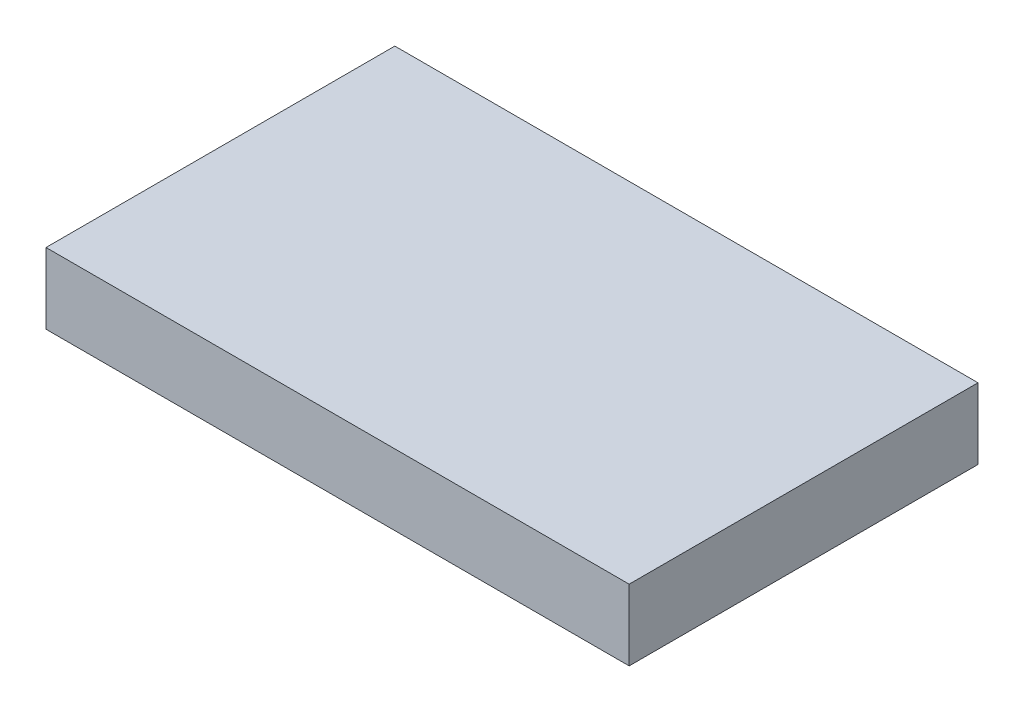
ISO-10303-21;
HEADER;
FILE_DESCRIPTION(('STEP AP214'),'2;1');
FILE_NAME('part.step','',(''),(''),'','','');
FILE_SCHEMA(('AUTOMOTIVE_DESIGN { 1 0 10303 214 1 1 1 1 }'));
ENDSEC;
DATA;
#1=APPLICATION_CONTEXT('core data for automotive mechanical design processes');
#2=APPLICATION_PROTOCOL_DEFINITION('international standard','automotive_design',2000,#1);
#3=PRODUCT_CONTEXT('',#1,'mechanical');
#4=PRODUCT('Part','Part','',(#3));
#5=PRODUCT_RELATED_PRODUCT_CATEGORY('part','',(#4));
#6=PRODUCT_DEFINITION_FORMATION('','',#4);
#7=PRODUCT_DEFINITION_CONTEXT('part definition',#1,'design');
#8=PRODUCT_DEFINITION('design','',#6,#7);
#9=PRODUCT_DEFINITION_SHAPE('','',#8);
#10=(LENGTH_UNIT() NAMED_UNIT(*) SI_UNIT(.MILLI.,.METRE.));
#11=(NAMED_UNIT(*) PLANE_ANGLE_UNIT() SI_UNIT($,.RADIAN.));
#12=(NAMED_UNIT(*) SI_UNIT($,.STERADIAN.) SOLID_ANGLE_UNIT());
#13=UNCERTAINTY_MEASURE_WITH_UNIT(LENGTH_MEASURE(1.E-05),#10,'distance_accuracy_value','');
#14=(GEOMETRIC_REPRESENTATION_CONTEXT(3) GLOBAL_UNCERTAINTY_ASSIGNED_CONTEXT((#13)) GLOBAL_UNIT_ASSIGNED_CONTEXT((#10,
#11,#12)) REPRESENTATION_CONTEXT('',''));
#15=CARTESIAN_POINT('',(0.,0.,0.));
#16=DIRECTION('',(0.,0.,1.));
#17=DIRECTION('',(1.,0.,0.));
#18=AXIS2_PLACEMENT_3D('',#15,#16,#17);
#19=CARTESIAN_POINT('',(5.349494,-0.6494907,0.));
#20=DIRECTION('',(0.,-1.,0.));
#21=DIRECTION('',(0.,0.,-1.));
#22=AXIS2_PLACEMENT_3D('',#19,#20,#21);
#23=PLANE('',#22);
#24=DIRECTION('',(0.,0.,1.));
#25=VECTOR('',#24,1.);
#26=CARTESIAN_POINT('',(-5.349494,-0.6494907,0.));
#27=LINE('',#26,#25);
#28=CARTESIAN_POINT('',(-5.349494,-0.6494907,0.));
#29=VERTEX_POINT('',#28);
#30=CARTESIAN_POINT('',(-5.349494,-0.6494907,6.3999999));
#31=VERTEX_POINT('',#30);
#32=EDGE_CURVE('E19',#29,#31,#27,.T.);
#33=ORIENTED_EDGE('',*,*,#32,.F.);
#34=DIRECTION('',(1.,0.,0.));
#35=VECTOR('',#34,1.);
#36=CARTESIAN_POINT('',(-5.349494,-0.6494907,0.));
#37=LINE('',#36,#35);
#38=CARTESIAN_POINT('',(5.349494,-0.6494907,0.));
#39=VERTEX_POINT('',#38);
#40=EDGE_CURVE('E91',#29,#39,#37,.T.);
#41=ORIENTED_EDGE('',*,*,#40,.T.);
#42=DIRECTION('',(0.,0.,-1.));
#43=VECTOR('',#42,1.);
#44=CARTESIAN_POINT('',(5.349494,-0.6494907,0.));
#45=LINE('',#44,#43);
#46=CARTESIAN_POINT('',(5.349494,-0.6494907,6.3999999));
#47=VERTEX_POINT('',#46);
#48=EDGE_CURVE('E66',#47,#39,#45,.T.);
#49=ORIENTED_EDGE('',*,*,#48,.F.);
#50=DIRECTION('',(1.,0.,0.));
#51=VECTOR('',#50,1.);
#52=CARTESIAN_POINT('',(-5.349494,-0.6494907,6.3999999));
#53=LINE('',#52,#51);
#54=EDGE_CURVE('E59',#31,#47,#53,.T.);
#55=ORIENTED_EDGE('',*,*,#54,.F.);
#56=EDGE_LOOP('',(#33,#41,#49,#55));
#57=FACE_BOUND('',#56,.T.);
#58=ADVANCED_FACE('F16',(#57),#23,.T.);
#59=CARTESIAN_POINT('',(-5.349494,-0.6494907,0.));
#60=DIRECTION('',(-1.,0.,0.));
#61=DIRECTION('',(0.,0.,1.));
#62=AXIS2_PLACEMENT_3D('',#59,#60,#61);
#63=PLANE('',#62);
#64=DIRECTION('',(0.,0.,1.));
#65=VECTOR('',#64,1.);
#66=CARTESIAN_POINT('',(-5.349494,0.64949324,0.));
#67=LINE('',#66,#65);
#68=CARTESIAN_POINT('',(-5.349494,0.64949324,0.));
#69=VERTEX_POINT('',#68);
#70=CARTESIAN_POINT('',(-5.349494,0.64949324,6.3999999));
#71=VERTEX_POINT('',#70);
#72=EDGE_CURVE('E97',#69,#71,#67,.T.);
#73=ORIENTED_EDGE('',*,*,#72,.F.);
#74=DIRECTION('',(0.,1.,0.));
#75=VECTOR('',#74,1.);
#76=CARTESIAN_POINT('',(-5.349494,-0.6494907,0.));
#77=LINE('',#76,#75);
#78=EDGE_CURVE('E74',#69,#29,#77,.F.);
#79=ORIENTED_EDGE('',*,*,#78,.T.);
#80=ORIENTED_EDGE('',*,*,#32,.T.);
#81=DIRECTION('',(0.,1.,0.));
#82=VECTOR('',#81,1.);
#83=CARTESIAN_POINT('',(-5.349494,-0.6494907,6.3999999));
#84=LINE('',#83,#82);
#85=EDGE_CURVE('E69',#71,#31,#84,.F.);
#86=ORIENTED_EDGE('',*,*,#85,.F.);
#87=EDGE_LOOP('',(#73,#79,#80,#86));
#88=FACE_BOUND('',#87,.T.);
#89=ADVANCED_FACE('F71',(#88),#63,.T.);
#90=CARTESIAN_POINT('',(-5.349494,-0.6494907,6.3999999));
#91=DIRECTION('',(0.,0.,1.));
#92=DIRECTION('',(1.,0.,0.));
#93=AXIS2_PLACEMENT_3D('',#90,#91,#92);
#94=PLANE('',#93);
#95=DIRECTION('',(1.,0.,0.));
#96=VECTOR('',#95,1.);
#97=CARTESIAN_POINT('',(-5.349494,0.64949324,6.3999999));
#98=LINE('',#97,#96);
#99=CARTESIAN_POINT('',(5.349494,0.64949324,6.3999999));
#100=VERTEX_POINT('',#99);
#101=EDGE_CURVE('E79',#71,#100,#98,.T.);
#102=ORIENTED_EDGE('',*,*,#101,.F.);
#103=ORIENTED_EDGE('',*,*,#85,.T.);
#104=ORIENTED_EDGE('',*,*,#54,.T.);
#105=DIRECTION('',(0.,1.,0.));
#106=VECTOR('',#105,1.);
#107=CARTESIAN_POINT('',(5.349494,0.64949324,6.3999999));
#108=LINE('',#107,#106);
#109=EDGE_CURVE('E82',#100,#47,#108,.F.);
#110=ORIENTED_EDGE('',*,*,#109,.F.);
#111=EDGE_LOOP('',(#102,#103,#104,#110));
#112=FACE_BOUND('',#111,.T.);
#113=ADVANCED_FACE('F77',(#112),#94,.T.);
#114=CARTESIAN_POINT('',(5.349494,0.64949324,0.));
#115=DIRECTION('',(1.,0.,0.));
#116=DIRECTION('',(0.,0.,-1.));
#117=AXIS2_PLACEMENT_3D('',#114,#115,#116);
#118=PLANE('',#117);
#119=ORIENTED_EDGE('',*,*,#48,.T.);
#120=DIRECTION('',(0.,1.,0.));
#121=VECTOR('',#120,1.);
#122=CARTESIAN_POINT('',(5.349494,-0.6494907,0.));
#123=LINE('',#122,#121);
#124=CARTESIAN_POINT('',(5.349494,0.64949324,0.));
#125=VERTEX_POINT('',#124);
#126=EDGE_CURVE('E35',#39,#125,#123,.T.);
#127=ORIENTED_EDGE('',*,*,#126,.T.);
#128=DIRECTION('',(0.,0.,1.));
#129=VECTOR('',#128,1.);
#130=CARTESIAN_POINT('',(5.349494,0.64949324,0.));
#131=LINE('',#130,#129);
#132=EDGE_CURVE('E26',#100,#125,#131,.F.);
#133=ORIENTED_EDGE('',*,*,#132,.F.);
#134=ORIENTED_EDGE('',*,*,#109,.T.);
#135=EDGE_LOOP('',(#119,#127,#133,#134));
#136=FACE_BOUND('',#135,.T.);
#137=ADVANCED_FACE('F104',(#136),#118,.T.);
#138=CARTESIAN_POINT('',(-5.349494,-0.6494907,0.));
#139=DIRECTION('',(0.,0.,1.));
#140=DIRECTION('',(1.,0.,0.));
#141=AXIS2_PLACEMENT_3D('',#138,#139,#140);
#142=PLANE('',#141);
#143=DIRECTION('',(1.,0.,0.));
#144=VECTOR('',#143,1.);
#145=CARTESIAN_POINT('',(-5.349494,0.64949324,0.));
#146=LINE('',#145,#144);
#147=EDGE_CURVE('E11',#125,#69,#146,.F.);
#148=ORIENTED_EDGE('',*,*,#147,.F.);
#149=ORIENTED_EDGE('',*,*,#126,.F.);
#150=ORIENTED_EDGE('',*,*,#40,.F.);
#151=ORIENTED_EDGE('',*,*,#78,.F.);
#152=EDGE_LOOP('',(#148,#149,#150,#151));
#153=FACE_BOUND('',#152,.T.);
#154=ADVANCED_FACE('F106',(#153),#142,.F.);
#155=CARTESIAN_POINT('',(-5.349494,0.64949324,0.));
#156=DIRECTION('',(0.,1.,0.));
#157=DIRECTION('',(0.,0.,1.));
#158=AXIS2_PLACEMENT_3D('',#155,#156,#157);
#159=PLANE('',#158);
#160=ORIENTED_EDGE('',*,*,#132,.T.);
#161=ORIENTED_EDGE('',*,*,#147,.T.);
#162=ORIENTED_EDGE('',*,*,#72,.T.);
#163=ORIENTED_EDGE('',*,*,#101,.T.);
#164=EDGE_LOOP('',(#160,#161,#162,#163));
#165=FACE_BOUND('',#164,.T.);
#166=ADVANCED_FACE('F103',(#165),#159,.T.);
#167=CLOSED_SHELL('',(#58,#89,#113,#137,#154,#166));
#168=MANIFOLD_SOLID_BREP('B1',#167);
#169=ADVANCED_BREP_SHAPE_REPRESENTATION('',(#18,#168),#14);
#170=SHAPE_DEFINITION_REPRESENTATION(#9,#169);
ENDSEC;
END-ISO-10303-21;
